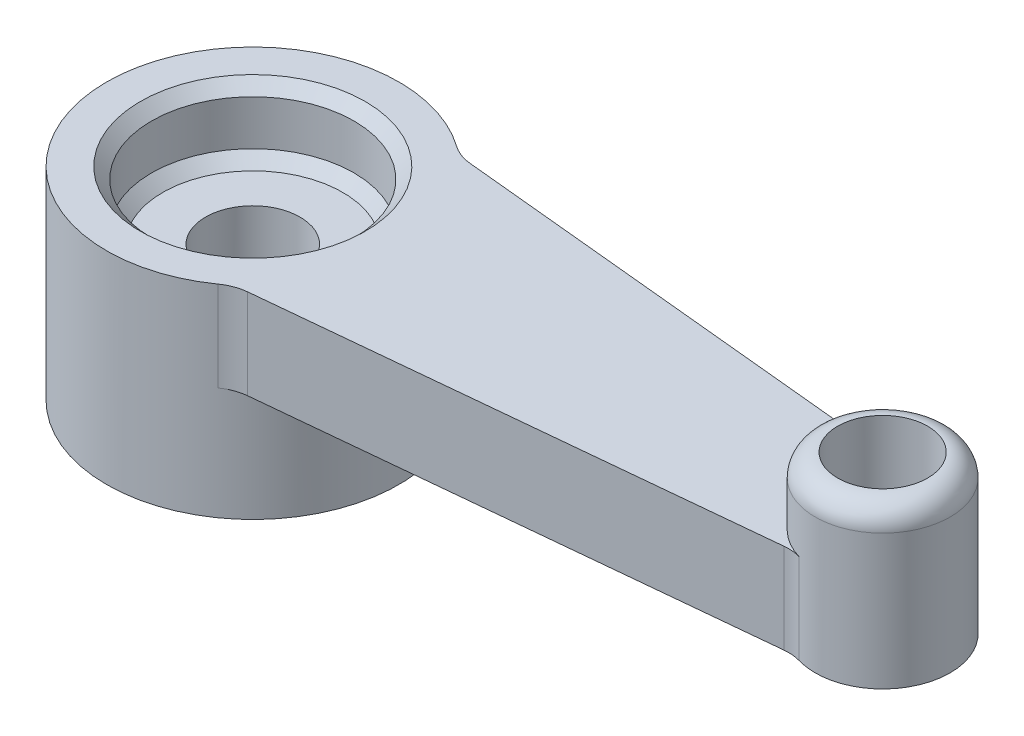
ISO-10303-21;
HEADER;
FILE_DESCRIPTION(('STEP AP214'),'2;1');
FILE_NAME('part.step','',(''),(''),'','','');
FILE_SCHEMA(('AUTOMOTIVE_DESIGN { 1 0 10303 214 1 1 1 1 }'));
ENDSEC;
DATA;
#1=APPLICATION_CONTEXT('core data for automotive mechanical design processes');
#2=APPLICATION_PROTOCOL_DEFINITION('international standard','automotive_design',2000,#1);
#3=PRODUCT_CONTEXT('',#1,'mechanical');
#4=PRODUCT('Part','Part','',(#3));
#5=PRODUCT_RELATED_PRODUCT_CATEGORY('part','',(#4));
#6=PRODUCT_DEFINITION_FORMATION('','',#4);
#7=PRODUCT_DEFINITION_CONTEXT('part definition',#1,'design');
#8=PRODUCT_DEFINITION('design','',#6,#7);
#9=PRODUCT_DEFINITION_SHAPE('','',#8);
#10=(LENGTH_UNIT() NAMED_UNIT(*) SI_UNIT(.MILLI.,.METRE.));
#11=(NAMED_UNIT(*) PLANE_ANGLE_UNIT() SI_UNIT($,.RADIAN.));
#12=(NAMED_UNIT(*) SI_UNIT($,.STERADIAN.) SOLID_ANGLE_UNIT());
#13=UNCERTAINTY_MEASURE_WITH_UNIT(LENGTH_MEASURE(1.E-05),#10,'distance_accuracy_value','');
#14=(GEOMETRIC_REPRESENTATION_CONTEXT(3) GLOBAL_UNCERTAINTY_ASSIGNED_CONTEXT((#13)) GLOBAL_UNIT_ASSIGNED_CONTEXT((#10,
#11,#12)) REPRESENTATION_CONTEXT('',''));
#15=CARTESIAN_POINT('',(0.,0.,0.));
#16=DIRECTION('',(0.,0.,1.));
#17=DIRECTION('',(1.,0.,0.));
#18=AXIS2_PLACEMENT_3D('',#15,#16,#17);
#19=CARTESIAN_POINT('',(13.3120953085474,1.,2.40349477542131));
#20=DIRECTION('',(0.,-1.,0.));
#21=DIRECTION('',(0.,0.,-1.));
#22=AXIS2_PLACEMENT_3D('',#19,#20,#21);
#23=CYLINDRICAL_SURFACE('',#22,1.);
#24=CARTESIAN_POINT('',(13.3120953085474,-1.,2.40349477542131));
#25=DIRECTION('',(0.,-1.,0.));
#26=DIRECTION('',(0.,0.,-1.));
#27=AXIS2_PLACEMENT_3D('',#24,#25,#26);
#28=CIRCLE('',#27,1.);
#29=CARTESIAN_POINT('',(13.2145428321259,-1.,1.40826439287462));
#30=VERTEX_POINT('',#29);
#31=CARTESIAN_POINT('',(13.5872571851285,-1.,1.44209686525279));
#32=VERTEX_POINT('',#31);
#33=EDGE_CURVE('E145',#30,#32,#28,.T.);
#34=ORIENTED_EDGE('',*,*,#33,.T.);
#35=DIRECTION('',(0.,-1.,0.));
#36=VECTOR('',#35,1.);
#37=CARTESIAN_POINT('',(13.5872571851285,1.,1.44209686525279));
#38=LINE('',#37,#36);
#39=CARTESIAN_POINT('',(13.5872571851285,1.,1.44209686525279));
#40=VERTEX_POINT('',#39);
#41=EDGE_CURVE('E173',#40,#32,#38,.T.);
#42=ORIENTED_EDGE('',*,*,#41,.F.);
#43=CARTESIAN_POINT('',(13.3120953085474,1.,2.40349477542131));
#44=DIRECTION('',(0.,-1.,0.));
#45=DIRECTION('',(0.,0.,-1.));
#46=AXIS2_PLACEMENT_3D('',#43,#44,#45);
#47=CIRCLE('',#46,1.);
#48=CARTESIAN_POINT('',(13.2145428321259,1.,1.40826439287462));
#49=VERTEX_POINT('',#48);
#50=EDGE_CURVE('E102',#49,#40,#47,.T.);
#51=ORIENTED_EDGE('',*,*,#50,.F.);
#52=DIRECTION('',(0.,-1.,0.));
#53=VECTOR('',#52,1.);
#54=CARTESIAN_POINT('',(13.2145428321259,1.,1.40826439287462));
#55=LINE('',#54,#53);
#56=EDGE_CURVE('E141',#49,#30,#55,.T.);
#57=ORIENTED_EDGE('',*,*,#56,.T.);
#58=EDGE_LOOP('',(#34,#42,#51,#57));
#59=FACE_BOUND('',#58,.T.);
#60=ADVANCED_FACE('F41',(#59),#23,.F.);
#61=CARTESIAN_POINT('',(14.,1.,0.));
#62=DIRECTION('',(0.,-1.,0.));
#63=DIRECTION('',(0.,0.,-1.));
#64=AXIS2_PLACEMENT_3D('',#61,#62,#63);
#65=CYLINDRICAL_SURFACE('',#64,1.5);
#66=CARTESIAN_POINT('',(14.,2.,0.));
#67=DIRECTION('',(0.,-1.,0.));
#68=DIRECTION('',(0.,0.,-1.));
#69=AXIS2_PLACEMENT_3D('',#66,#67,#68);
#70=CIRCLE('',#69,1.5);
#71=CARTESIAN_POINT('',(14.,2.,-1.5));
#72=VERTEX_POINT('',#71);
#73=EDGE_CURVE('E177',#72,#72,#70,.T.);
#74=ORIENTED_EDGE('',*,*,#73,.T.);
#75=EDGE_LOOP('',(#74));
#76=FACE_BOUND('',#75,.T.);
#77=CARTESIAN_POINT('',(14.,-1.,0.));
#78=DIRECTION('',(0.,1.,0.));
#79=DIRECTION('',(0.,0.,1.));
#80=AXIS2_PLACEMENT_3D('',#77,#78,#79);
#81=CIRCLE('',#80,1.5);
#82=CARTESIAN_POINT('',(13.5872571851285,-1.,-1.44209686525279));
#83=VERTEX_POINT('',#82);
#84=EDGE_CURVE('E148',#32,#83,#81,.T.);
#85=ORIENTED_EDGE('',*,*,#84,.T.);
#86=DIRECTION('',(0.,-1.,0.));
#87=VECTOR('',#86,1.);
#88=CARTESIAN_POINT('',(13.5872571851285,1.,-1.44209686525279));
#89=LINE('',#88,#87);
#90=CARTESIAN_POINT('',(13.5872571851285,1.,-1.44209686525279));
#91=VERTEX_POINT('',#90);
#92=EDGE_CURVE('E170',#91,#83,#89,.T.);
#93=ORIENTED_EDGE('',*,*,#92,.F.);
#94=CARTESIAN_POINT('',(14.,1.,0.));
#95=DIRECTION('',(0.,-1.,0.));
#96=DIRECTION('',(0.,0.,-1.));
#97=AXIS2_PLACEMENT_3D('',#94,#95,#96);
#98=CIRCLE('',#97,1.5);
#99=EDGE_CURVE('E274',#40,#91,#98,.T.);
#100=ORIENTED_EDGE('',*,*,#99,.F.);
#101=ORIENTED_EDGE('',*,*,#41,.T.);
#102=EDGE_LOOP('',(#85,#93,#100,#101));
#103=FACE_BOUND('',#102,.T.);
#104=ADVANCED_FACE('F214',(#76,#103),#65,.T.);
#105=CARTESIAN_POINT('',(13.3120953085474,1.,-2.40349477542131));
#106=DIRECTION('',(0.,-1.,0.));
#107=DIRECTION('',(0.,0.,-1.));
#108=AXIS2_PLACEMENT_3D('',#105,#106,#107);
#109=CYLINDRICAL_SURFACE('',#108,1.);
#110=CARTESIAN_POINT('',(13.3120953085474,-1.,-2.40349477542131));
#111=DIRECTION('',(0.,-1.,0.));
#112=DIRECTION('',(0.,0.,1.));
#113=AXIS2_PLACEMENT_3D('',#110,#111,#112);
#114=CIRCLE('',#113,1.);
#115=CARTESIAN_POINT('',(13.2145428321259,-1.,-1.40826439287462));
#116=VERTEX_POINT('',#115);
#117=EDGE_CURVE('E151',#83,#116,#114,.T.);
#118=ORIENTED_EDGE('',*,*,#117,.T.);
#119=DIRECTION('',(0.,-1.,0.));
#120=VECTOR('',#119,1.);
#121=CARTESIAN_POINT('',(13.2145428321259,1.,-1.40826439287462));
#122=LINE('',#121,#120);
#123=CARTESIAN_POINT('',(13.2145428321259,1.,-1.40826439287462));
#124=VERTEX_POINT('',#123);
#125=EDGE_CURVE('E167',#124,#116,#122,.T.);
#126=ORIENTED_EDGE('',*,*,#125,.F.);
#127=CARTESIAN_POINT('',(13.3120953085474,1.,-2.40349477542131));
#128=DIRECTION('',(0.,-1.,0.));
#129=DIRECTION('',(0.,0.,1.));
#130=AXIS2_PLACEMENT_3D('',#127,#128,#129);
#131=CIRCLE('',#130,1.);
#132=EDGE_CURVE('E257',#91,#124,#131,.T.);
#133=ORIENTED_EDGE('',*,*,#132,.F.);
#134=ORIENTED_EDGE('',*,*,#92,.T.);
#135=EDGE_LOOP('',(#118,#126,#133,#134));
#136=FACE_BOUND('',#135,.T.);
#137=ADVANCED_FACE('F222',(#136),#109,.F.);
#138=CARTESIAN_POINT('',(2.35992391637082,1.,-2.4722340770936));
#139=DIRECTION('',(-0.0975524764214793,0.,0.995230382546693));
#140=DIRECTION('',(0.995230382546693,0.,0.0975524764214793));
#141=AXIS2_PLACEMENT_3D('',#138,#139,#140);
#142=PLANE('',#141);
#143=DIRECTION('',(-0.995230382546693,0.,-0.0975524764214793));
#144=VECTOR('',#143,1.);
#145=CARTESIAN_POINT('',(2.35992391637082,-1.,-2.4722340770936));
#146=LINE('',#145,#144);
#147=CARTESIAN_POINT('',(2.35992391637082,-1.,-2.4722340770936));
#148=VERTEX_POINT('',#147);
#149=EDGE_CURVE('E153',#116,#148,#146,.T.);
#150=ORIENTED_EDGE('',*,*,#149,.T.);
#151=DIRECTION('',(0.,-1.,0.));
#152=VECTOR('',#151,1.);
#153=CARTESIAN_POINT('',(2.35992391637082,1.,-2.4722340770936));
#154=LINE('',#153,#152);
#155=CARTESIAN_POINT('',(2.35992391637082,1.,-2.4722340770936));
#156=VERTEX_POINT('',#155);
#157=EDGE_CURVE('E164',#156,#148,#154,.T.);
#158=ORIENTED_EDGE('',*,*,#157,.F.);
#159=DIRECTION('',(-0.995230382546693,0.,-0.0975524764214793));
#160=VECTOR('',#159,1.);
#161=CARTESIAN_POINT('',(2.35992391637082,1.,-2.4722340770936));
#162=LINE('',#161,#160);
#163=EDGE_CURVE('E267',#124,#156,#162,.T.);
#164=ORIENTED_EDGE('',*,*,#163,.F.);
#165=ORIENTED_EDGE('',*,*,#125,.T.);
#166=EDGE_LOOP('',(#150,#158,#164,#165));
#167=FACE_BOUND('',#166,.T.);
#168=ADVANCED_FACE('F263',(#167),#142,.F.);
#169=CARTESIAN_POINT('',(2.4574763927923,1.,-3.4674644596403));
#170=DIRECTION('',(0.,-1.,0.));
#171=DIRECTION('',(0.,0.,-1.));
#172=AXIS2_PLACEMENT_3D('',#169,#170,#171);
#173=CYLINDRICAL_SURFACE('',#172,1.);
#174=CARTESIAN_POINT('',(2.4574763927923,-1.,-3.4674644596403));
#175=DIRECTION('',(0.,-1.,0.));
#176=DIRECTION('',(0.,0.,1.));
#177=AXIS2_PLACEMENT_3D('',#174,#175,#176);
#178=CIRCLE('',#177,1.);
#179=CARTESIAN_POINT('',(1.87924665331176,-1.,-2.6515904691367));
#180=VERTEX_POINT('',#179);
#181=EDGE_CURVE('E155',#148,#180,#178,.T.);
#182=ORIENTED_EDGE('',*,*,#181,.T.);
#183=DIRECTION('',(0.,-1.,0.));
#184=VECTOR('',#183,1.);
#185=CARTESIAN_POINT('',(1.87924665331176,1.,-2.6515904691367));
#186=LINE('',#185,#184);
#187=CARTESIAN_POINT('',(1.87924665331176,1.,-2.6515904691367));
#188=VERTEX_POINT('',#187);
#189=EDGE_CURVE('E136',#188,#180,#186,.T.);
#190=ORIENTED_EDGE('',*,*,#189,.F.);
#191=CARTESIAN_POINT('',(2.4574763927923,1.,-3.4674644596403));
#192=DIRECTION('',(0.,-1.,0.));
#193=DIRECTION('',(0.,0.,1.));
#194=AXIS2_PLACEMENT_3D('',#191,#192,#193);
#195=CIRCLE('',#194,1.);
#196=EDGE_CURVE('E123',#156,#188,#195,.T.);
#197=ORIENTED_EDGE('',*,*,#196,.F.);
#198=ORIENTED_EDGE('',*,*,#157,.T.);
#199=EDGE_LOOP('',(#182,#190,#197,#198));
#200=FACE_BOUND('',#199,.T.);
#201=ADVANCED_FACE('F266',(#200),#173,.F.);
#202=CARTESIAN_POINT('',(0.,1.,0.));
#203=DIRECTION('',(0.,-1.,0.));
#204=DIRECTION('',(0.,0.,-1.));
#205=AXIS2_PLACEMENT_3D('',#202,#203,#204);
#206=CYLINDRICAL_SURFACE('',#205,3.25);
#207=ORIENTED_EDGE('',*,*,#189,.T.);
#208=CARTESIAN_POINT('',(0.,-1.,0.));
#209=DIRECTION('',(0.,-1.,0.));
#210=DIRECTION('',(0.,0.,-1.));
#211=AXIS2_PLACEMENT_3D('',#208,#209,#210);
#212=CIRCLE('',#211,3.25);
#213=CARTESIAN_POINT('',(1.87924665331176,-1.,2.6515904691367));
#214=VERTEX_POINT('',#213);
#215=EDGE_CURVE('E133',#180,#214,#212,.T.);
#216=ORIENTED_EDGE('',*,*,#215,.T.);
#217=DIRECTION('',(0.,-1.,0.));
#218=VECTOR('',#217,1.);
#219=CARTESIAN_POINT('',(1.87924665331176,1.,2.6515904691367));
#220=LINE('',#219,#218);
#221=CARTESIAN_POINT('',(1.87924665331176,1.,2.6515904691367));
#222=VERTEX_POINT('',#221);
#223=EDGE_CURVE('E129',#222,#214,#220,.T.);
#224=ORIENTED_EDGE('',*,*,#223,.F.);
#225=CARTESIAN_POINT('',(0.,1.,0.));
#226=DIRECTION('',(0.,1.,0.));
#227=DIRECTION('',(0.,0.,1.));
#228=AXIS2_PLACEMENT_3D('',#225,#226,#227);
#229=CIRCLE('',#228,3.25);
#230=EDGE_CURVE('E116',#188,#222,#229,.T.);
#231=ORIENTED_EDGE('',*,*,#230,.F.);
#232=EDGE_LOOP('',(#207,#216,#224,#231));
#233=FACE_BOUND('',#232,.T.);
#234=CARTESIAN_POINT('',(0.,-3.5,0.));
#235=DIRECTION('',(0.,1.,0.));
#236=DIRECTION('',(0.,0.,1.));
#237=AXIS2_PLACEMENT_3D('',#234,#235,#236);
#238=CIRCLE('',#237,3.25);
#239=CARTESIAN_POINT('',(0.,-3.5,3.25));
#240=VERTEX_POINT('',#239);
#241=EDGE_CURVE('E149',#240,#240,#238,.T.);
#242=ORIENTED_EDGE('',*,*,#241,.T.);
#243=EDGE_LOOP('',(#242));
#244=FACE_BOUND('',#243,.T.);
#245=ADVANCED_FACE('F130',(#233,#244),#206,.T.);
#246=CARTESIAN_POINT('',(2.4574763927923,1.,3.4674644596403));
#247=DIRECTION('',(0.,-1.,0.));
#248=DIRECTION('',(0.,0.,-1.));
#249=AXIS2_PLACEMENT_3D('',#246,#247,#248);
#250=CYLINDRICAL_SURFACE('',#249,1.);
#251=CARTESIAN_POINT('',(2.4574763927923,-1.,3.4674644596403));
#252=DIRECTION('',(0.,-1.,0.));
#253=DIRECTION('',(0.,0.,-1.));
#254=AXIS2_PLACEMENT_3D('',#251,#252,#253);
#255=CIRCLE('',#254,1.);
#256=CARTESIAN_POINT('',(2.35992391637082,-1.,2.4722340770936));
#257=VERTEX_POINT('',#256);
#258=EDGE_CURVE('E158',#214,#257,#255,.T.);
#259=ORIENTED_EDGE('',*,*,#258,.T.);
#260=DIRECTION('',(0.,-1.,0.));
#261=VECTOR('',#260,1.);
#262=CARTESIAN_POINT('',(2.35992391637082,1.,2.4722340770936));
#263=LINE('',#262,#261);
#264=CARTESIAN_POINT('',(2.35992391637082,1.,2.4722340770936));
#265=VERTEX_POINT('',#264);
#266=EDGE_CURVE('E137',#265,#257,#263,.T.);
#267=ORIENTED_EDGE('',*,*,#266,.F.);
#268=CARTESIAN_POINT('',(2.4574763927923,1.,3.4674644596403));
#269=DIRECTION('',(0.,-1.,0.));
#270=DIRECTION('',(0.,0.,-1.));
#271=AXIS2_PLACEMENT_3D('',#268,#269,#270);
#272=CIRCLE('',#271,1.);
#273=EDGE_CURVE('E120',#222,#265,#272,.T.);
#274=ORIENTED_EDGE('',*,*,#273,.F.);
#275=ORIENTED_EDGE('',*,*,#223,.T.);
#276=EDGE_LOOP('',(#259,#267,#274,#275));
#277=FACE_BOUND('',#276,.T.);
#278=ADVANCED_FACE('F139',(#277),#250,.F.);
#279=CARTESIAN_POINT('',(2.35992391637082,1.,2.4722340770936));
#280=DIRECTION('',(-0.0975524764214793,0.,-0.995230382546693));
#281=DIRECTION('',(-0.995230382546693,0.,0.0975524764214793));
#282=AXIS2_PLACEMENT_3D('',#279,#280,#281);
#283=PLANE('',#282);
#284=DIRECTION('',(0.995230382546693,0.,-0.0975524764214793));
#285=VECTOR('',#284,1.);
#286=CARTESIAN_POINT('',(2.35992391637082,-1.,2.4722340770936));
#287=LINE('',#286,#285);
#288=EDGE_CURVE('E96',#257,#30,#287,.T.);
#289=ORIENTED_EDGE('',*,*,#288,.T.);
#290=ORIENTED_EDGE('',*,*,#56,.F.);
#291=DIRECTION('',(0.995230382546693,0.,-0.0975524764214793));
#292=VECTOR('',#291,1.);
#293=CARTESIAN_POINT('',(2.35992391637082,1.,2.4722340770936));
#294=LINE('',#293,#292);
#295=EDGE_CURVE('E66',#265,#49,#294,.T.);
#296=ORIENTED_EDGE('',*,*,#295,.F.);
#297=ORIENTED_EDGE('',*,*,#266,.T.);
#298=EDGE_LOOP('',(#289,#290,#296,#297));
#299=FACE_BOUND('',#298,.T.);
#300=ADVANCED_FACE('F333',(#299),#283,.F.);
#301=CARTESIAN_POINT('',(13.3120953085474,1.,2.40349477542131));
#302=DIRECTION('',(0.,-1.,0.));
#303=DIRECTION('',(0.,0.,-1.));
#304=AXIS2_PLACEMENT_3D('',#301,#302,#303);
#305=PLANE('',#304);
#306=CARTESIAN_POINT('',(0.,1.,0.));
#307=DIRECTION('',(0.,-1.,0.));
#308=DIRECTION('',(0.,0.,-1.));
#309=AXIS2_PLACEMENT_3D('',#306,#307,#308);
#310=CIRCLE('',#309,2.5);
#311=CARTESIAN_POINT('',(0.,1.,-2.5));
#312=VERTEX_POINT('',#311);
#313=EDGE_CURVE('E11',#312,#312,#310,.T.);
#314=ORIENTED_EDGE('',*,*,#313,.T.);
#315=EDGE_LOOP('',(#314));
#316=FACE_BOUND('',#315,.T.);
#317=ORIENTED_EDGE('',*,*,#50,.T.);
#318=ORIENTED_EDGE('',*,*,#99,.T.);
#319=ORIENTED_EDGE('',*,*,#132,.T.);
#320=ORIENTED_EDGE('',*,*,#163,.T.);
#321=ORIENTED_EDGE('',*,*,#196,.T.);
#322=ORIENTED_EDGE('',*,*,#230,.T.);
#323=ORIENTED_EDGE('',*,*,#273,.T.);
#324=ORIENTED_EDGE('',*,*,#295,.T.);
#325=EDGE_LOOP('',(#317,#318,#319,#320,#321,#322,#323,#324));
#326=FACE_BOUND('',#325,.T.);
#327=ADVANCED_FACE('F118',(#316,#326),#305,.F.);
#328=CARTESIAN_POINT('',(13.3120953085474,-1.,2.40349477542131));
#329=DIRECTION('',(0.,-1.,0.));
#330=DIRECTION('',(0.,0.,-1.));
#331=AXIS2_PLACEMENT_3D('',#328,#329,#330);
#332=PLANE('',#331);
#333=ORIENTED_EDGE('',*,*,#117,.F.);
#334=ORIENTED_EDGE('',*,*,#84,.F.);
#335=ORIENTED_EDGE('',*,*,#33,.F.);
#336=ORIENTED_EDGE('',*,*,#288,.F.);
#337=ORIENTED_EDGE('',*,*,#258,.F.);
#338=ORIENTED_EDGE('',*,*,#215,.F.);
#339=ORIENTED_EDGE('',*,*,#181,.F.);
#340=ORIENTED_EDGE('',*,*,#149,.F.);
#341=EDGE_LOOP('',(#333,#334,#335,#336,#337,#338,#339,#340));
#342=FACE_BOUND('',#341,.T.);
#343=ADVANCED_FACE('F259',(#342),#332,.T.);
#344=CARTESIAN_POINT('',(0.,-3.5,0.));
#345=DIRECTION('',(0.,1.,0.));
#346=DIRECTION('',(0.,0.,1.));
#347=AXIS2_PLACEMENT_3D('',#344,#345,#346);
#348=PLANE('',#347);
#349=DIRECTION('',(0.,0.,1.));
#350=VECTOR('',#349,1.);
#351=CARTESIAN_POINT('',(1.73205080756888,-3.5,1.));
#352=LINE('',#351,#350);
#353=CARTESIAN_POINT('',(1.73205080756888,-3.5,-1.));
#354=VERTEX_POINT('',#353);
#355=CARTESIAN_POINT('',(1.73205080756888,-3.5,1.));
#356=VERTEX_POINT('',#355);
#357=EDGE_CURVE('E285',#354,#356,#352,.T.);
#358=ORIENTED_EDGE('',*,*,#357,.F.);
#359=CARTESIAN_POINT('',(0.,-3.5,0.));
#360=DIRECTION('',(0.,-1.,0.));
#361=DIRECTION('',(0.,0.,-1.));
#362=AXIS2_PLACEMENT_3D('',#359,#360,#361);
#363=CIRCLE('',#362,2.);
#364=EDGE_CURVE('E57',#356,#354,#363,.T.);
#365=ORIENTED_EDGE('',*,*,#364,.F.);
#366=EDGE_LOOP('',(#358,#365));
#367=FACE_BOUND('',#366,.T.);
#368=ORIENTED_EDGE('',*,*,#241,.F.);
#369=EDGE_LOOP('',(#368));
#370=FACE_BOUND('',#369,.T.);
#371=ADVANCED_FACE('F324',(#367,#370),#348,.F.);
#372=CARTESIAN_POINT('',(14.,0.10086061902756,0.));
#373=DIRECTION('',(0.,1.,0.));
#374=DIRECTION('',(0.,0.,1.));
#375=AXIS2_PLACEMENT_3D('',#372,#373,#374);
#376=CONICAL_SURFACE('',#375,0.999999999999999,1.02974425867665);
#377=CARTESIAN_POINT('',(14.,-0.5,0.));
#378=VERTEX_POINT('',#377);
#379=VERTEX_LOOP('',#378);
#380=FACE_BOUND('',#379,.T.);
#381=CARTESIAN_POINT('',(14.,0.10086061902756,0.));
#382=DIRECTION('',(0.,1.,0.));
#383=DIRECTION('',(0.,0.,1.));
#384=AXIS2_PLACEMENT_3D('',#381,#382,#383);
#385=CIRCLE('',#384,0.999999999999999);
#386=CARTESIAN_POINT('',(14.,0.10086061902756,0.999999999999999));
#387=VERTEX_POINT('',#386);
#388=EDGE_CURVE('E276',#387,#387,#385,.T.);
#389=ORIENTED_EDGE('',*,*,#388,.T.);
#390=EDGE_LOOP('',(#389));
#391=FACE_BOUND('',#390,.T.);
#392=ADVANCED_FACE('F239',(#380,#391),#376,.F.);
#393=CARTESIAN_POINT('',(14.,2.5,0.));
#394=DIRECTION('',(0.,1.,0.));
#395=DIRECTION('',(0.,0.,1.));
#396=AXIS2_PLACEMENT_3D('',#393,#394,#395);
#397=CYLINDRICAL_SURFACE('',#396,0.999999999999999);
#398=ORIENTED_EDGE('',*,*,#388,.F.);
#399=EDGE_LOOP('',(#398));
#400=FACE_BOUND('',#399,.T.);
#401=CARTESIAN_POINT('',(14.,2.5,0.));
#402=DIRECTION('',(0.,1.,0.));
#403=DIRECTION('',(0.,0.,1.));
#404=AXIS2_PLACEMENT_3D('',#401,#402,#403);
#405=CIRCLE('',#404,0.999999999999999);
#406=CARTESIAN_POINT('',(14.,2.5,0.999999999999999));
#407=VERTEX_POINT('',#406);
#408=EDGE_CURVE('E245',#407,#407,#405,.T.);
#409=ORIENTED_EDGE('',*,*,#408,.T.);
#410=EDGE_LOOP('',(#409));
#411=FACE_BOUND('',#410,.T.);
#412=ADVANCED_FACE('F228',(#400,#411),#397,.F.);
#413=CARTESIAN_POINT('',(14.,2.,0.));
#414=DIRECTION('',(0.,-1.,0.));
#415=DIRECTION('',(0.,0.,-1.));
#416=AXIS2_PLACEMENT_3D('',#413,#414,#415);
#417=TOROIDAL_SURFACE('',#416,1.,0.5);
#418=ORIENTED_EDGE('',*,*,#408,.F.);
#419=EDGE_LOOP('',(#418));
#420=FACE_BOUND('',#419,.T.);
#421=ORIENTED_EDGE('',*,*,#73,.F.);
#422=EDGE_LOOP('',(#421));
#423=FACE_BOUND('',#422,.T.);
#424=ADVANCED_FACE('F210',(#420,#423),#417,.T.);
#425=CARTESIAN_POINT('',(0.,2.5,0.));
#426=DIRECTION('',(0.,-1.,0.));
#427=DIRECTION('',(0.,0.,-1.));
#428=AXIS2_PLACEMENT_3D('',#425,#426,#427);
#429=CYLINDRICAL_SURFACE('',#428,2.25);
#430=CARTESIAN_POINT('',(0.,-0.249999999999999,0.));
#431=DIRECTION('',(0.,1.,0.));
#432=DIRECTION('',(0.,0.,1.));
#433=AXIS2_PLACEMENT_3D('',#430,#431,#432);
#434=CIRCLE('',#433,2.25);
#435=CARTESIAN_POINT('',(0.,-0.249999999999999,2.25));
#436=VERTEX_POINT('',#435);
#437=EDGE_CURVE('E50',#436,#436,#434,.F.);
#438=ORIENTED_EDGE('',*,*,#437,.T.);
#439=EDGE_LOOP('',(#438));
#440=FACE_BOUND('',#439,.T.);
#441=CARTESIAN_POINT('',(0.,0.749999999999998,0.));
#442=DIRECTION('',(0.,-1.,0.));
#443=DIRECTION('',(0.,0.,-1.));
#444=AXIS2_PLACEMENT_3D('',#441,#442,#443);
#445=CIRCLE('',#444,2.25);
#446=CARTESIAN_POINT('',(0.,0.749999999999998,-2.25));
#447=VERTEX_POINT('',#446);
#448=EDGE_CURVE('E183',#447,#447,#445,.F.);
#449=ORIENTED_EDGE('',*,*,#448,.T.);
#450=EDGE_LOOP('',(#449));
#451=FACE_BOUND('',#450,.T.);
#452=ADVANCED_FACE('F188',(#440,#451),#429,.F.);
#453=CARTESIAN_POINT('',(0.,-0.5,0.));
#454=DIRECTION('',(0.,1.,0.));
#455=DIRECTION('',(0.,0.,1.));
#456=AXIS2_PLACEMENT_3D('',#453,#454,#455);
#457=PLANE('',#456);
#458=CARTESIAN_POINT('',(0.,-0.5,0.));
#459=DIRECTION('',(0.,1.,0.));
#460=DIRECTION('',(0.,0.,1.));
#461=AXIS2_PLACEMENT_3D('',#458,#459,#460);
#462=CIRCLE('',#461,1.05);
#463=CARTESIAN_POINT('',(0.,-0.5,1.05));
#464=VERTEX_POINT('',#463);
#465=EDGE_CURVE('E297',#464,#464,#462,.T.);
#466=ORIENTED_EDGE('',*,*,#465,.F.);
#467=EDGE_LOOP('',(#466));
#468=FACE_BOUND('',#467,.T.);
#469=CARTESIAN_POINT('',(0.,-0.5,0.));
#470=DIRECTION('',(0.,1.,0.));
#471=DIRECTION('',(0.,0.,1.));
#472=AXIS2_PLACEMENT_3D('',#469,#470,#471);
#473=CIRCLE('',#472,2.);
#474=CARTESIAN_POINT('',(0.,-0.5,2.));
#475=VERTEX_POINT('',#474);
#476=EDGE_CURVE('E180',#475,#475,#473,.T.);
#477=ORIENTED_EDGE('',*,*,#476,.T.);
#478=EDGE_LOOP('',(#477));
#479=FACE_BOUND('',#478,.T.);
#480=ADVANCED_FACE('F197',(#468,#479),#457,.T.);
#481=CARTESIAN_POINT('',(0.,-2.,0.));
#482=DIRECTION('',(0.,-1.,0.));
#483=DIRECTION('',(0.,0.,-1.));
#484=AXIS2_PLACEMENT_3D('',#481,#482,#483);
#485=CYLINDRICAL_SURFACE('',#484,2.);
#486=ORIENTED_EDGE('',*,*,#364,.T.);
#487=DIRECTION('',(0.,-1.,0.));
#488=VECTOR('',#487,1.);
#489=CARTESIAN_POINT('',(1.73205080756888,-2.,-1.));
#490=LINE('',#489,#488);
#491=CARTESIAN_POINT('',(1.73205080756888,-2.,-1.));
#492=VERTEX_POINT('',#491);
#493=EDGE_CURVE('E281',#492,#354,#490,.T.);
#494=ORIENTED_EDGE('',*,*,#493,.F.);
#495=CARTESIAN_POINT('',(0.,-2.,0.));
#496=DIRECTION('',(0.,-1.,0.));
#497=DIRECTION('',(0.,0.,-1.));
#498=AXIS2_PLACEMENT_3D('',#495,#496,#497);
#499=CIRCLE('',#498,2.);
#500=CARTESIAN_POINT('',(1.73205080756888,-2.,1.));
#501=VERTEX_POINT('',#500);
#502=EDGE_CURVE('E288',#501,#492,#499,.T.);
#503=ORIENTED_EDGE('',*,*,#502,.F.);
#504=DIRECTION('',(0.,-1.,0.));
#505=VECTOR('',#504,1.);
#506=CARTESIAN_POINT('',(1.73205080756888,-2.,1.));
#507=LINE('',#506,#505);
#508=EDGE_CURVE('E280',#501,#356,#507,.T.);
#509=ORIENTED_EDGE('',*,*,#508,.T.);
#510=EDGE_LOOP('',(#486,#494,#503,#509));
#511=FACE_BOUND('',#510,.T.);
#512=ADVANCED_FACE('F199',(#511),#485,.F.);
#513=CARTESIAN_POINT('',(1.73205080756888,-2.,1.));
#514=DIRECTION('',(1.,0.,0.));
#515=DIRECTION('',(0.,0.,-1.));
#516=AXIS2_PLACEMENT_3D('',#513,#514,#515);
#517=PLANE('',#516);
#518=ORIENTED_EDGE('',*,*,#357,.T.);
#519=ORIENTED_EDGE('',*,*,#508,.F.);
#520=DIRECTION('',(0.,0.,1.));
#521=VECTOR('',#520,1.);
#522=CARTESIAN_POINT('',(1.73205080756888,-2.,1.));
#523=LINE('',#522,#521);
#524=EDGE_CURVE('E283',#492,#501,#523,.T.);
#525=ORIENTED_EDGE('',*,*,#524,.F.);
#526=ORIENTED_EDGE('',*,*,#493,.T.);
#527=EDGE_LOOP('',(#518,#519,#525,#526));
#528=FACE_BOUND('',#527,.T.);
#529=ADVANCED_FACE('F207',(#528),#517,.F.);
#530=CARTESIAN_POINT('',(0.,-2.,0.));
#531=DIRECTION('',(0.,-1.,0.));
#532=DIRECTION('',(0.,0.,-1.));
#533=AXIS2_PLACEMENT_3D('',#530,#531,#532);
#534=PLANE('',#533);
#535=CARTESIAN_POINT('',(0.,-2.,0.));
#536=DIRECTION('',(0.,-1.,0.));
#537=DIRECTION('',(0.,0.,-1.));
#538=AXIS2_PLACEMENT_3D('',#535,#536,#537);
#539=CIRCLE('',#538,1.05);
#540=CARTESIAN_POINT('',(0.,-2.,-1.05));
#541=VERTEX_POINT('',#540);
#542=EDGE_CURVE('E290',#541,#541,#539,.T.);
#543=ORIENTED_EDGE('',*,*,#542,.F.);
#544=EDGE_LOOP('',(#543));
#545=FACE_BOUND('',#544,.T.);
#546=ORIENTED_EDGE('',*,*,#502,.T.);
#547=ORIENTED_EDGE('',*,*,#524,.T.);
#548=EDGE_LOOP('',(#546,#547));
#549=FACE_BOUND('',#548,.T.);
#550=ADVANCED_FACE('F194',(#545,#549),#534,.T.);
#551=CARTESIAN_POINT('',(0.,-0.5,0.));
#552=DIRECTION('',(0.,1.,0.));
#553=DIRECTION('',(0.,0.,1.));
#554=AXIS2_PLACEMENT_3D('',#551,#552,#553);
#555=CONICAL_SURFACE('',#554,2.,0.78539816339745);
#556=ORIENTED_EDGE('',*,*,#437,.F.);
#557=EDGE_LOOP('',(#556));
#558=FACE_BOUND('',#557,.T.);
#559=ORIENTED_EDGE('',*,*,#476,.F.);
#560=EDGE_LOOP('',(#559));
#561=FACE_BOUND('',#560,.T.);
#562=ADVANCED_FACE('F191',(#558,#561),#555,.F.);
#563=CARTESIAN_POINT('',(0.,0.749999999999998,0.));
#564=DIRECTION('',(0.,1.,0.));
#565=DIRECTION('',(0.,0.,1.));
#566=AXIS2_PLACEMENT_3D('',#563,#564,#565);
#567=CONICAL_SURFACE('',#566,2.25,0.785398163397454);
#568=ORIENTED_EDGE('',*,*,#313,.F.);
#569=EDGE_LOOP('',(#568));
#570=FACE_BOUND('',#569,.T.);
#571=ORIENTED_EDGE('',*,*,#448,.F.);
#572=EDGE_LOOP('',(#571));
#573=FACE_BOUND('',#572,.T.);
#574=ADVANCED_FACE('F44',(#570,#573),#567,.F.);
#575=CARTESIAN_POINT('',(0.,-0.5,0.));
#576=DIRECTION('',(0.,1.,0.));
#577=DIRECTION('',(0.,0.,1.));
#578=AXIS2_PLACEMENT_3D('',#575,#576,#577);
#579=CYLINDRICAL_SURFACE('',#578,1.05);
#580=ORIENTED_EDGE('',*,*,#542,.T.);
#581=EDGE_LOOP('',(#580));
#582=FACE_BOUND('',#581,.T.);
#583=ORIENTED_EDGE('',*,*,#465,.T.);
#584=EDGE_LOOP('',(#583));
#585=FACE_BOUND('',#584,.T.);
#586=ADVANCED_FACE('F300',(#582,#585),#579,.F.);
#587=CLOSED_SHELL('',(#60,#104,#137,#168,#201,#245,#278,#300,#327,#343,#371,#392,#412,#424,#452,
#480,#512,#529,#550,#562,#574,#586));
#588=MANIFOLD_SOLID_BREP('B2',#587);
#589=ADVANCED_BREP_SHAPE_REPRESENTATION('',(#18,#588),#14);
#590=SHAPE_DEFINITION_REPRESENTATION(#9,#589);
ENDSEC;
END-ISO-10303-21;
